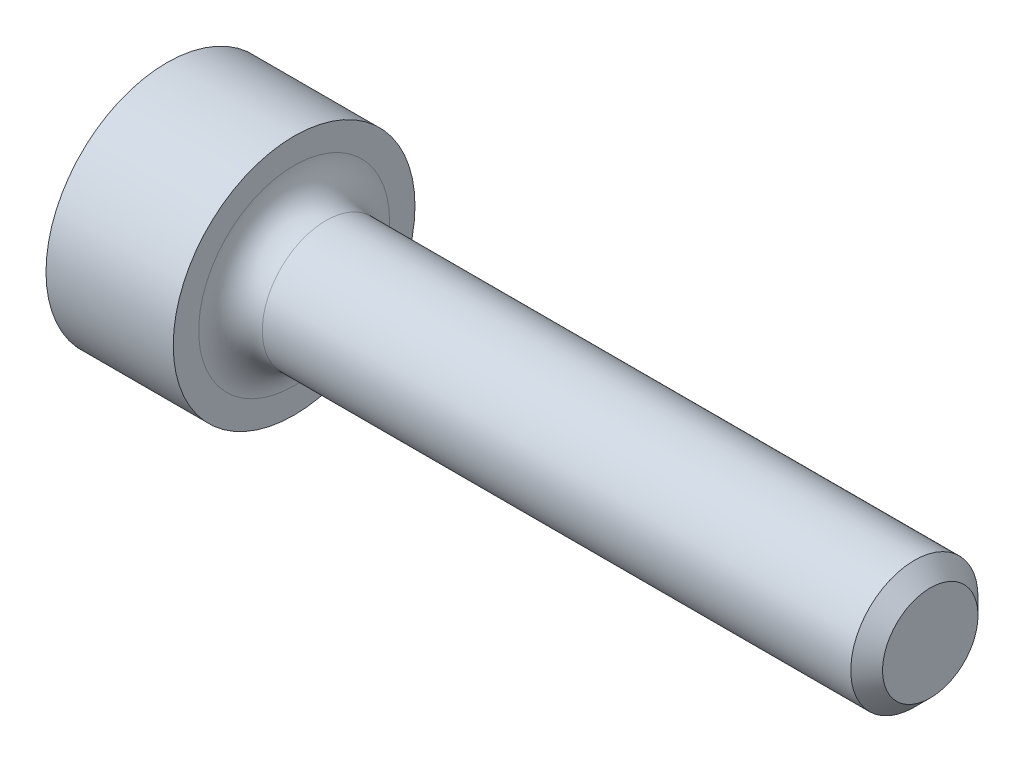
ISO-10303-21;
HEADER;
FILE_DESCRIPTION(('STEP AP214'),'2;1');
FILE_NAME('part.step','',(''),(''),'','','');
FILE_SCHEMA(('AUTOMOTIVE_DESIGN { 1 0 10303 214 1 1 1 1 }'));
ENDSEC;
DATA;
#1=APPLICATION_CONTEXT('core data for automotive mechanical design processes');
#2=APPLICATION_PROTOCOL_DEFINITION('international standard','automotive_design',2000,#1);
#3=PRODUCT_CONTEXT('',#1,'mechanical');
#4=PRODUCT('Part','Part','',(#3));
#5=PRODUCT_RELATED_PRODUCT_CATEGORY('part','',(#4));
#6=PRODUCT_DEFINITION_FORMATION('','',#4);
#7=PRODUCT_DEFINITION_CONTEXT('part definition',#1,'design');
#8=PRODUCT_DEFINITION('design','',#6,#7);
#9=PRODUCT_DEFINITION_SHAPE('','',#8);
#10=(LENGTH_UNIT() NAMED_UNIT(*) SI_UNIT(.MILLI.,.METRE.));
#11=(NAMED_UNIT(*) PLANE_ANGLE_UNIT() SI_UNIT($,.RADIAN.));
#12=(NAMED_UNIT(*) SI_UNIT($,.STERADIAN.) SOLID_ANGLE_UNIT());
#13=UNCERTAINTY_MEASURE_WITH_UNIT(LENGTH_MEASURE(1.E-05),#10,'distance_accuracy_value','');
#14=(GEOMETRIC_REPRESENTATION_CONTEXT(3) GLOBAL_UNCERTAINTY_ASSIGNED_CONTEXT((#13)) GLOBAL_UNIT_ASSIGNED_CONTEXT((#10,
#11,#12)) REPRESENTATION_CONTEXT('',''));
#15=CARTESIAN_POINT('',(0.,0.,0.));
#16=DIRECTION('',(0.,0.,1.));
#17=DIRECTION('',(1.,0.,0.));
#18=AXIS2_PLACEMENT_3D('',#15,#16,#17);
#19=CARTESIAN_POINT('',(12.,0.,0.));
#20=DIRECTION('',(1.,0.,0.));
#21=DIRECTION('',(0.,0.,-1.));
#22=AXIS2_PLACEMENT_3D('',#19,#20,#21);
#23=PLANE('',#22);
#24=CARTESIAN_POINT('',(12.,0.,0.));
#25=DIRECTION('',(1.,0.,0.));
#26=DIRECTION('',(0.,0.,-1.));
#27=AXIS2_PLACEMENT_3D('',#24,#25,#26);
#28=CIRCLE('',#27,0.750000000000001);
#29=CARTESIAN_POINT('',(12.,0.,-0.750000000000001));
#30=VERTEX_POINT('',#29);
#31=EDGE_CURVE('E11',#30,#30,#28,.T.);
#32=ORIENTED_EDGE('',*,*,#31,.T.);
#33=EDGE_LOOP('',(#32));
#34=FACE_BOUND('',#33,.T.);
#35=ADVANCED_FACE('F37',(#34),#23,.T.);
#36=CARTESIAN_POINT('',(0.,0.,0.));
#37=DIRECTION('',(-1.,0.,0.));
#38=DIRECTION('',(0.,0.,1.));
#39=AXIS2_PLACEMENT_3D('',#36,#37,#38);
#40=CYLINDRICAL_SURFACE('',#39,1.);
#41=CARTESIAN_POINT('',(11.75,0.,0.));
#42=DIRECTION('',(1.,0.,0.));
#43=DIRECTION('',(0.,0.,-1.));
#44=AXIS2_PLACEMENT_3D('',#41,#42,#43);
#45=CIRCLE('',#44,1.);
#46=CARTESIAN_POINT('',(11.75,0.,-1.));
#47=VERTEX_POINT('',#46);
#48=EDGE_CURVE('E45',#47,#47,#45,.F.);
#49=ORIENTED_EDGE('',*,*,#48,.T.);
#50=EDGE_LOOP('',(#49));
#51=FACE_BOUND('',#50,.T.);
#52=CARTESIAN_POINT('',(2.5,0.,0.));
#53=DIRECTION('',(1.,0.,0.));
#54=DIRECTION('',(0.,0.,-1.));
#55=AXIS2_PLACEMENT_3D('',#52,#53,#54);
#56=CIRCLE('',#55,1.);
#57=CARTESIAN_POINT('',(2.5,0.,-1.));
#58=VERTEX_POINT('',#57);
#59=EDGE_CURVE('E131',#58,#58,#56,.T.);
#60=ORIENTED_EDGE('',*,*,#59,.T.);
#61=EDGE_LOOP('',(#60));
#62=FACE_BOUND('',#61,.T.);
#63=ADVANCED_FACE('F136',(#51,#62),#40,.T.);
#64=CARTESIAN_POINT('',(2.,-1.9,0.));
#65=DIRECTION('',(1.,0.,0.));
#66=DIRECTION('',(0.,0.,-1.));
#67=AXIS2_PLACEMENT_3D('',#64,#65,#66);
#68=PLANE('',#67);
#69=CARTESIAN_POINT('',(2.,0.,0.));
#70=DIRECTION('',(1.,0.,0.));
#71=DIRECTION('',(0.,0.,-1.));
#72=AXIS2_PLACEMENT_3D('',#69,#70,#71);
#73=CIRCLE('',#72,1.5);
#74=CARTESIAN_POINT('',(2.,0.,-1.5));
#75=VERTEX_POINT('',#74);
#76=EDGE_CURVE('E128',#75,#75,#73,.F.);
#77=ORIENTED_EDGE('',*,*,#76,.T.);
#78=EDGE_LOOP('',(#77));
#79=FACE_BOUND('',#78,.T.);
#80=CARTESIAN_POINT('',(2.,0.,0.));
#81=DIRECTION('',(-1.,0.,0.));
#82=DIRECTION('',(0.,0.,1.));
#83=AXIS2_PLACEMENT_3D('',#80,#81,#82);
#84=CIRCLE('',#83,1.9);
#85=CARTESIAN_POINT('',(2.,0.,1.9));
#86=VERTEX_POINT('',#85);
#87=EDGE_CURVE('E125',#86,#86,#84,.T.);
#88=ORIENTED_EDGE('',*,*,#87,.F.);
#89=EDGE_LOOP('',(#88));
#90=FACE_BOUND('',#89,.T.);
#91=ADVANCED_FACE('F155',(#79,#90),#68,.T.);
#92=CARTESIAN_POINT('',(0.,0.,0.));
#93=DIRECTION('',(-1.,0.,0.));
#94=DIRECTION('',(0.,0.,1.));
#95=AXIS2_PLACEMENT_3D('',#92,#93,#94);
#96=CYLINDRICAL_SURFACE('',#95,1.9);
#97=ORIENTED_EDGE('',*,*,#87,.T.);
#98=EDGE_LOOP('',(#97));
#99=FACE_BOUND('',#98,.T.);
#100=CARTESIAN_POINT('',(0.,0.,0.));
#101=DIRECTION('',(-1.,0.,0.));
#102=DIRECTION('',(0.,0.,1.));
#103=AXIS2_PLACEMENT_3D('',#100,#101,#102);
#104=CIRCLE('',#103,1.9);
#105=CARTESIAN_POINT('',(0.,0.,1.9));
#106=VERTEX_POINT('',#105);
#107=EDGE_CURVE('E114',#106,#106,#104,.T.);
#108=ORIENTED_EDGE('',*,*,#107,.F.);
#109=EDGE_LOOP('',(#108));
#110=FACE_BOUND('',#109,.T.);
#111=ADVANCED_FACE('F167',(#99,#110),#96,.T.);
#112=CARTESIAN_POINT('',(0.,0.,0.));
#113=DIRECTION('',(-1.,0.,0.));
#114=DIRECTION('',(0.,0.,1.));
#115=AXIS2_PLACEMENT_3D('',#112,#113,#114);
#116=PLANE('',#115);
#117=DIRECTION('',(0.,0.5,-0.866025403784439));
#118=VECTOR('',#117,1.);
#119=CARTESIAN_POINT('',(0.,0.43301270189222,0.749999999999999));
#120=LINE('',#119,#118);
#121=CARTESIAN_POINT('',(0.,0.43301270189222,0.749999999999999));
#122=VERTEX_POINT('',#121);
#123=CARTESIAN_POINT('',(0.,0.866025403784439,0.));
#124=VERTEX_POINT('',#123);
#125=EDGE_CURVE('E52',#122,#124,#120,.T.);
#126=ORIENTED_EDGE('',*,*,#125,.F.);
#127=DIRECTION('',(0.,1.,0.));
#128=VECTOR('',#127,1.);
#129=CARTESIAN_POINT('',(0.,-0.433012701892219,0.75));
#130=LINE('',#129,#128);
#131=CARTESIAN_POINT('',(0.,-0.433012701892219,0.75));
#132=VERTEX_POINT('',#131);
#133=EDGE_CURVE('E87',#132,#122,#130,.T.);
#134=ORIENTED_EDGE('',*,*,#133,.F.);
#135=DIRECTION('',(0.,0.5,0.866025403784439));
#136=VECTOR('',#135,1.);
#137=CARTESIAN_POINT('',(0.,-0.866025403784438,0.));
#138=LINE('',#137,#136);
#139=CARTESIAN_POINT('',(0.,-0.866025403784438,0.));
#140=VERTEX_POINT('',#139);
#141=EDGE_CURVE('E96',#140,#132,#138,.T.);
#142=ORIENTED_EDGE('',*,*,#141,.F.);
#143=DIRECTION('',(0.,-0.5,0.866025403784439));
#144=VECTOR('',#143,1.);
#145=CARTESIAN_POINT('',(0.,-0.433012701892219,-0.75));
#146=LINE('',#145,#144);
#147=CARTESIAN_POINT('',(0.,-0.433012701892219,-0.75));
#148=VERTEX_POINT('',#147);
#149=EDGE_CURVE('E102',#148,#140,#146,.T.);
#150=ORIENTED_EDGE('',*,*,#149,.F.);
#151=DIRECTION('',(0.,-1.,0.));
#152=VECTOR('',#151,1.);
#153=CARTESIAN_POINT('',(0.,0.433012701892219,-0.75));
#154=LINE('',#153,#152);
#155=CARTESIAN_POINT('',(0.,0.433012701892219,-0.75));
#156=VERTEX_POINT('',#155);
#157=EDGE_CURVE('E245',#156,#148,#154,.T.);
#158=ORIENTED_EDGE('',*,*,#157,.F.);
#159=DIRECTION('',(0.,-0.5,-0.866025403784438));
#160=VECTOR('',#159,1.);
#161=CARTESIAN_POINT('',(0.,0.866025403784439,0.));
#162=LINE('',#161,#160);
#163=EDGE_CURVE('E243',#124,#156,#162,.T.);
#164=ORIENTED_EDGE('',*,*,#163,.F.);
#165=EDGE_LOOP('',(#126,#134,#142,#150,#158,#164));
#166=FACE_BOUND('',#165,.T.);
#167=ORIENTED_EDGE('',*,*,#107,.T.);
#168=EDGE_LOOP('',(#167));
#169=FACE_BOUND('',#168,.T.);
#170=ADVANCED_FACE('F104',(#166,#169),#116,.T.);
#171=CARTESIAN_POINT('',(2.5,0.,0.));
#172=DIRECTION('',(1.,0.,0.));
#173=DIRECTION('',(0.,0.,-1.));
#174=AXIS2_PLACEMENT_3D('',#171,#172,#173);
#175=TOROIDAL_SURFACE('',#174,1.5,0.5);
#176=ORIENTED_EDGE('',*,*,#59,.F.);
#177=EDGE_LOOP('',(#176));
#178=FACE_BOUND('',#177,.T.);
#179=ORIENTED_EDGE('',*,*,#76,.F.);
#180=EDGE_LOOP('',(#179));
#181=FACE_BOUND('',#180,.T.);
#182=ADVANCED_FACE('F158',(#178,#181),#175,.F.);
#183=CARTESIAN_POINT('',(1.,0.43301270189222,0.749999999999999));
#184=DIRECTION('',(0.,0.866025403784439,0.5));
#185=DIRECTION('',(0.,-0.5,0.866025403784439));
#186=AXIS2_PLACEMENT_3D('',#183,#184,#185);
#187=PLANE('',#186);
#188=ORIENTED_EDGE('',*,*,#125,.T.);
#189=DIRECTION('',(-1.,0.,0.));
#190=VECTOR('',#189,1.);
#191=CARTESIAN_POINT('',(1.,0.866025403784439,0.));
#192=LINE('',#191,#190);
#193=CARTESIAN_POINT('',(1.,0.866025403784439,0.));
#194=VERTEX_POINT('',#193);
#195=EDGE_CURVE('E121',#194,#124,#192,.T.);
#196=ORIENTED_EDGE('',*,*,#195,.F.);
#197=DIRECTION('',(0.,0.5,-0.866025403784439));
#198=VECTOR('',#197,1.);
#199=CARTESIAN_POINT('',(1.,0.43301270189222,0.749999999999999));
#200=LINE('',#199,#198);
#201=CARTESIAN_POINT('',(1.,0.43301270189222,0.749999999999999));
#202=VERTEX_POINT('',#201);
#203=EDGE_CURVE('E107',#202,#194,#200,.T.);
#204=ORIENTED_EDGE('',*,*,#203,.F.);
#205=DIRECTION('',(-1.,0.,0.));
#206=VECTOR('',#205,1.);
#207=CARTESIAN_POINT('',(1.,0.43301270189222,0.749999999999999));
#208=LINE('',#207,#206);
#209=EDGE_CURVE('E92',#202,#122,#208,.T.);
#210=ORIENTED_EDGE('',*,*,#209,.T.);
#211=EDGE_LOOP('',(#188,#196,#204,#210));
#212=FACE_BOUND('',#211,.T.);
#213=ADVANCED_FACE('F160',(#212),#187,.F.);
#214=CARTESIAN_POINT('',(1.,-0.433012701892219,0.75));
#215=DIRECTION('',(0.,0.,1.));
#216=DIRECTION('',(0.,-1.,0.));
#217=AXIS2_PLACEMENT_3D('',#214,#215,#216);
#218=PLANE('',#217);
#219=ORIENTED_EDGE('',*,*,#133,.T.);
#220=ORIENTED_EDGE('',*,*,#209,.F.);
#221=DIRECTION('',(0.,1.,0.));
#222=VECTOR('',#221,1.);
#223=CARTESIAN_POINT('',(1.,-0.433012701892219,0.75));
#224=LINE('',#223,#222);
#225=CARTESIAN_POINT('',(1.,-0.433012701892219,0.75));
#226=VERTEX_POINT('',#225);
#227=EDGE_CURVE('E89',#226,#202,#224,.T.);
#228=ORIENTED_EDGE('',*,*,#227,.F.);
#229=DIRECTION('',(-1.,0.,0.));
#230=VECTOR('',#229,1.);
#231=CARTESIAN_POINT('',(1.,-0.433012701892219,0.75));
#232=LINE('',#231,#230);
#233=EDGE_CURVE('E82',#226,#132,#232,.T.);
#234=ORIENTED_EDGE('',*,*,#233,.T.);
#235=EDGE_LOOP('',(#219,#220,#228,#234));
#236=FACE_BOUND('',#235,.T.);
#237=ADVANCED_FACE('F84',(#236),#218,.F.);
#238=CARTESIAN_POINT('',(1.,-0.866025403784438,0.));
#239=DIRECTION('',(0.,-0.866025403784439,0.5));
#240=DIRECTION('',(0.,-0.5,-0.866025403784439));
#241=AXIS2_PLACEMENT_3D('',#238,#239,#240);
#242=PLANE('',#241);
#243=ORIENTED_EDGE('',*,*,#141,.T.);
#244=ORIENTED_EDGE('',*,*,#233,.F.);
#245=DIRECTION('',(0.,0.5,0.866025403784439));
#246=VECTOR('',#245,1.);
#247=CARTESIAN_POINT('',(1.,-0.866025403784438,0.));
#248=LINE('',#247,#246);
#249=CARTESIAN_POINT('',(1.,-0.866025403784438,0.));
#250=VERTEX_POINT('',#249);
#251=EDGE_CURVE('E238',#250,#226,#248,.T.);
#252=ORIENTED_EDGE('',*,*,#251,.F.);
#253=DIRECTION('',(-1.,0.,0.));
#254=VECTOR('',#253,1.);
#255=CARTESIAN_POINT('',(1.,-0.866025403784438,0.));
#256=LINE('',#255,#254);
#257=EDGE_CURVE('E93',#250,#140,#256,.T.);
#258=ORIENTED_EDGE('',*,*,#257,.T.);
#259=EDGE_LOOP('',(#243,#244,#252,#258));
#260=FACE_BOUND('',#259,.T.);
#261=ADVANCED_FACE('F97',(#260),#242,.F.);
#262=CARTESIAN_POINT('',(1.,-0.433012701892219,-0.75));
#263=DIRECTION('',(0.,-0.866025403784439,-0.5));
#264=DIRECTION('',(0.,0.5,-0.866025403784439));
#265=AXIS2_PLACEMENT_3D('',#262,#263,#264);
#266=PLANE('',#265);
#267=ORIENTED_EDGE('',*,*,#149,.T.);
#268=ORIENTED_EDGE('',*,*,#257,.F.);
#269=DIRECTION('',(0.,-0.5,0.866025403784439));
#270=VECTOR('',#269,1.);
#271=CARTESIAN_POINT('',(1.,-0.433012701892219,-0.75));
#272=LINE('',#271,#270);
#273=CARTESIAN_POINT('',(1.,-0.433012701892219,-0.75));
#274=VERTEX_POINT('',#273);
#275=EDGE_CURVE('E233',#274,#250,#272,.T.);
#276=ORIENTED_EDGE('',*,*,#275,.F.);
#277=DIRECTION('',(-1.,0.,0.));
#278=VECTOR('',#277,1.);
#279=CARTESIAN_POINT('',(1.,-0.433012701892219,-0.75));
#280=LINE('',#279,#278);
#281=EDGE_CURVE('E117',#274,#148,#280,.T.);
#282=ORIENTED_EDGE('',*,*,#281,.T.);
#283=EDGE_LOOP('',(#267,#268,#276,#282));
#284=FACE_BOUND('',#283,.T.);
#285=ADVANCED_FACE('F192',(#284),#266,.F.);
#286=CARTESIAN_POINT('',(1.,0.433012701892219,-0.75));
#287=DIRECTION('',(0.,0.,-1.));
#288=DIRECTION('',(0.,1.,0.));
#289=AXIS2_PLACEMENT_3D('',#286,#287,#288);
#290=PLANE('',#289);
#291=ORIENTED_EDGE('',*,*,#157,.T.);
#292=ORIENTED_EDGE('',*,*,#281,.F.);
#293=DIRECTION('',(0.,-1.,0.));
#294=VECTOR('',#293,1.);
#295=CARTESIAN_POINT('',(1.,0.433012701892219,-0.75));
#296=LINE('',#295,#294);
#297=CARTESIAN_POINT('',(1.,0.433012701892219,-0.75));
#298=VERTEX_POINT('',#297);
#299=EDGE_CURVE('E230',#298,#274,#296,.T.);
#300=ORIENTED_EDGE('',*,*,#299,.F.);
#301=DIRECTION('',(-1.,0.,0.));
#302=VECTOR('',#301,1.);
#303=CARTESIAN_POINT('',(1.,0.433012701892219,-0.75));
#304=LINE('',#303,#302);
#305=EDGE_CURVE('E119',#298,#156,#304,.T.);
#306=ORIENTED_EDGE('',*,*,#305,.T.);
#307=EDGE_LOOP('',(#291,#292,#300,#306));
#308=FACE_BOUND('',#307,.T.);
#309=ADVANCED_FACE('F188',(#308),#290,.F.);
#310=CARTESIAN_POINT('',(1.,0.866025403784439,0.));
#311=DIRECTION('',(0.,0.866025403784438,-0.5));
#312=DIRECTION('',(0.,0.5,0.866025403784439));
#313=AXIS2_PLACEMENT_3D('',#310,#311,#312);
#314=PLANE('',#313);
#315=ORIENTED_EDGE('',*,*,#163,.T.);
#316=ORIENTED_EDGE('',*,*,#305,.F.);
#317=DIRECTION('',(0.,-0.5,-0.866025403784438));
#318=VECTOR('',#317,1.);
#319=CARTESIAN_POINT('',(1.,0.866025403784439,0.));
#320=LINE('',#319,#318);
#321=EDGE_CURVE('E110',#194,#298,#320,.T.);
#322=ORIENTED_EDGE('',*,*,#321,.F.);
#323=ORIENTED_EDGE('',*,*,#195,.T.);
#324=EDGE_LOOP('',(#315,#316,#322,#323));
#325=FACE_BOUND('',#324,.T.);
#326=ADVANCED_FACE('F184',(#325),#314,.F.);
#327=CARTESIAN_POINT('',(1.,-0.866025403784438,0.));
#328=DIRECTION('',(-1.,0.,0.));
#329=DIRECTION('',(0.,0.,1.));
#330=AXIS2_PLACEMENT_3D('',#327,#328,#329);
#331=PLANE('',#330);
#332=CARTESIAN_POINT('',(1.,0.,0.));
#333=DIRECTION('',(-1.,0.,0.));
#334=DIRECTION('',(0.,0.,1.));
#335=AXIS2_PLACEMENT_3D('',#332,#333,#334);
#336=CIRCLE('',#335,0.866025403784438);
#337=EDGE_CURVE('E61',#202,#194,#336,.T.);
#338=ORIENTED_EDGE('',*,*,#337,.F.);
#339=ORIENTED_EDGE('',*,*,#203,.T.);
#340=EDGE_LOOP('',(#338,#339));
#341=FACE_BOUND('',#340,.T.);
#342=ADVANCED_FACE('F187',(#341),#331,.F.);
#343=EDGE_CURVE('E261',#226,#202,#336,.T.);
#344=ORIENTED_EDGE('',*,*,#343,.F.);
#345=ORIENTED_EDGE('',*,*,#227,.T.);
#346=EDGE_LOOP('',(#344,#345));
#347=FACE_BOUND('',#346,.T.);
#348=ADVANCED_FACE('F202',(#347),#331,.F.);
#349=EDGE_CURVE('E260',#250,#226,#336,.T.);
#350=ORIENTED_EDGE('',*,*,#349,.F.);
#351=ORIENTED_EDGE('',*,*,#251,.T.);
#352=EDGE_LOOP('',(#350,#351));
#353=FACE_BOUND('',#352,.T.);
#354=ADVANCED_FACE('F207',(#353),#331,.F.);
#355=EDGE_CURVE('E257',#274,#250,#336,.T.);
#356=ORIENTED_EDGE('',*,*,#355,.F.);
#357=ORIENTED_EDGE('',*,*,#275,.T.);
#358=EDGE_LOOP('',(#356,#357));
#359=FACE_BOUND('',#358,.T.);
#360=ADVANCED_FACE('F215',(#359),#331,.F.);
#361=EDGE_CURVE('E224',#298,#274,#336,.T.);
#362=ORIENTED_EDGE('',*,*,#361,.F.);
#363=ORIENTED_EDGE('',*,*,#299,.T.);
#364=EDGE_LOOP('',(#362,#363));
#365=FACE_BOUND('',#364,.T.);
#366=ADVANCED_FACE('F210',(#365),#331,.F.);
#367=EDGE_CURVE('E218',#194,#298,#336,.T.);
#368=ORIENTED_EDGE('',*,*,#367,.F.);
#369=ORIENTED_EDGE('',*,*,#321,.T.);
#370=EDGE_LOOP('',(#368,#369));
#371=FACE_BOUND('',#370,.T.);
#372=ADVANCED_FACE('F145',(#371),#331,.F.);
#373=CARTESIAN_POINT('',(1.,0.,0.));
#374=DIRECTION('',(-1.,0.,0.));
#375=DIRECTION('',(0.,0.,1.));
#376=AXIS2_PLACEMENT_3D('',#373,#374,#375);
#377=CONICAL_SURFACE('',#376,0.866025403784438,1.04719755119659);
#378=CARTESIAN_POINT('',(1.50000000000001,0.,0.));
#379=VERTEX_POINT('',#378);
#380=VERTEX_LOOP('',#379);
#381=FACE_BOUND('',#380,.T.);
#382=ORIENTED_EDGE('',*,*,#337,.T.);
#383=ORIENTED_EDGE('',*,*,#367,.T.);
#384=ORIENTED_EDGE('',*,*,#361,.T.);
#385=ORIENTED_EDGE('',*,*,#355,.T.);
#386=ORIENTED_EDGE('',*,*,#349,.T.);
#387=ORIENTED_EDGE('',*,*,#343,.T.);
#388=EDGE_LOOP('',(#382,#383,#384,#385,#386,#387));
#389=FACE_BOUND('',#388,.T.);
#390=ADVANCED_FACE('F140',(#381,#389),#377,.F.);
#391=CARTESIAN_POINT('',(11.75,0.,0.));
#392=DIRECTION('',(-1.,0.,0.));
#393=DIRECTION('',(0.,0.,1.));
#394=AXIS2_PLACEMENT_3D('',#391,#392,#393);
#395=CONICAL_SURFACE('',#394,1.,0.785398163397453);
#396=ORIENTED_EDGE('',*,*,#31,.F.);
#397=EDGE_LOOP('',(#396));
#398=FACE_BOUND('',#397,.T.);
#399=ORIENTED_EDGE('',*,*,#48,.F.);
#400=EDGE_LOOP('',(#399));
#401=FACE_BOUND('',#400,.T.);
#402=ADVANCED_FACE('F39',(#398,#401),#395,.T.);
#403=CLOSED_SHELL('',(#35,#63,#91,#111,#170,#182,#213,#237,#261,#285,#309,#326,#342,#348,#354,
#360,#366,#372,#390,#402));
#404=MANIFOLD_SOLID_BREP('B2',#403);
#405=ADVANCED_BREP_SHAPE_REPRESENTATION('',(#18,#404),#14);
#406=SHAPE_DEFINITION_REPRESENTATION(#9,#405);
ENDSEC;
END-ISO-10303-21;
